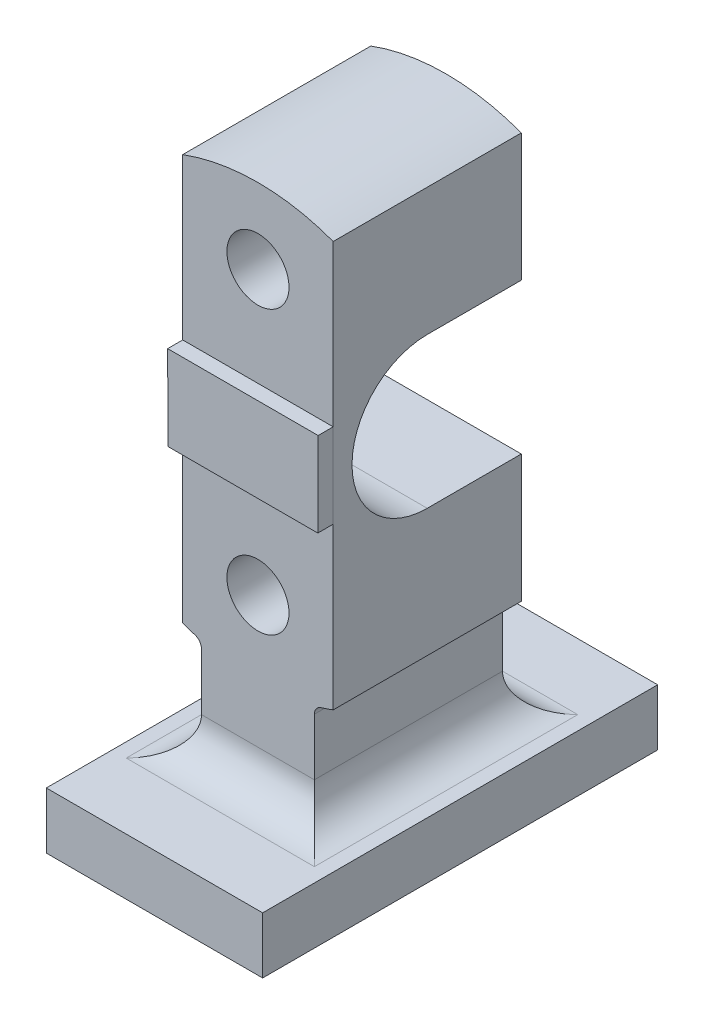
ISO-10303-21;
HEADER;
FILE_DESCRIPTION(('STEP AP214'),'2;1');
FILE_NAME('part.step','',(''),(''),'','','');
FILE_SCHEMA(('AUTOMOTIVE_DESIGN { 1 0 10303 214 1 1 1 1 }'));
ENDSEC;
DATA;
#1=APPLICATION_CONTEXT('core data for automotive mechanical design processes');
#2=APPLICATION_PROTOCOL_DEFINITION('international standard','automotive_design',2000,#1);
#3=PRODUCT_CONTEXT('',#1,'mechanical');
#4=PRODUCT('Part','Part','',(#3));
#5=PRODUCT_RELATED_PRODUCT_CATEGORY('part','',(#4));
#6=PRODUCT_DEFINITION_FORMATION('','',#4);
#7=PRODUCT_DEFINITION_CONTEXT('part definition',#1,'design');
#8=PRODUCT_DEFINITION('design','',#6,#7);
#9=PRODUCT_DEFINITION_SHAPE('','',#8);
#10=(LENGTH_UNIT() NAMED_UNIT(*) SI_UNIT(.MILLI.,.METRE.));
#11=(NAMED_UNIT(*) PLANE_ANGLE_UNIT() SI_UNIT($,.RADIAN.));
#12=(NAMED_UNIT(*) SI_UNIT($,.STERADIAN.) SOLID_ANGLE_UNIT());
#13=UNCERTAINTY_MEASURE_WITH_UNIT(LENGTH_MEASURE(1.E-05),#10,'distance_accuracy_value','');
#14=(GEOMETRIC_REPRESENTATION_CONTEXT(3) GLOBAL_UNCERTAINTY_ASSIGNED_CONTEXT((#13)) GLOBAL_UNIT_ASSIGNED_CONTEXT((#10,
#11,#12)) REPRESENTATION_CONTEXT('',''));
#15=CARTESIAN_POINT('',(0.,0.,0.));
#16=DIRECTION('',(0.,0.,1.));
#17=DIRECTION('',(1.,0.,0.));
#18=AXIS2_PLACEMENT_3D('',#15,#16,#17);
#19=CARTESIAN_POINT('',(0.,0.,50.));
#20=DIRECTION('',(0.,0.,1.));
#21=DIRECTION('',(1.,0.,0.));
#22=AXIS2_PLACEMENT_3D('',#19,#20,#21);
#23=PLANE('',#22);
#24=DIRECTION('',(1.,0.,0.));
#25=VECTOR('',#24,1.);
#26=CARTESIAN_POINT('',(0.,22.5,50.));
#27=LINE('',#26,#25);
#28=CARTESIAN_POINT('',(-40.,22.5000000000028,50.));
#29=VERTEX_POINT('',#28);
#30=CARTESIAN_POINT('',(40.,22.5,50.));
#31=VERTEX_POINT('',#30);
#32=EDGE_CURVE('E204',#29,#31,#27,.T.);
#33=ORIENTED_EDGE('',*,*,#32,.T.);
#34=DIRECTION('',(0.,-1.,0.));
#35=VECTOR('',#34,1.);
#36=CARTESIAN_POINT('',(40.,0.,50.));
#37=LINE('',#36,#35);
#38=CARTESIAN_POINT('',(40.,107.819293264239,50.));
#39=VERTEX_POINT('',#38);
#40=EDGE_CURVE('E321',#39,#31,#37,.T.);
#41=ORIENTED_EDGE('',*,*,#40,.F.);
#42=CARTESIAN_POINT('',(0.,0.,50.));
#43=DIRECTION('',(0.,0.,1.));
#44=DIRECTION('',(1.,0.,0.));
#45=AXIS2_PLACEMENT_3D('',#42,#43,#44);
#46=CIRCLE('',#45,115.);
#47=CARTESIAN_POINT('',(-40.,107.819293264239,50.));
#48=VERTEX_POINT('',#47);
#49=EDGE_CURVE('E324',#39,#48,#46,.T.);
#50=ORIENTED_EDGE('',*,*,#49,.T.);
#51=DIRECTION('',(0.,-1.,0.));
#52=VECTOR('',#51,1.);
#53=CARTESIAN_POINT('',(-40.,0.,50.));
#54=LINE('',#53,#52);
#55=EDGE_CURVE('E328',#48,#29,#54,.T.);
#56=ORIENTED_EDGE('',*,*,#55,.T.);
#57=EDGE_LOOP('',(#33,#41,#50,#56));
#58=FACE_BOUND('',#57,.T.);
#59=CARTESIAN_POINT('',(0.,75.,50.));
#60=DIRECTION('',(0.,0.,1.));
#61=DIRECTION('',(1.,0.,0.));
#62=AXIS2_PLACEMENT_3D('',#59,#60,#61);
#63=CIRCLE('',#62,16.5);
#64=CARTESIAN_POINT('',(16.5,75.,50.));
#65=VERTEX_POINT('',#64);
#66=EDGE_CURVE('E288',#65,#65,#63,.T.);
#67=ORIENTED_EDGE('',*,*,#66,.F.);
#68=EDGE_LOOP('',(#67));
#69=FACE_BOUND('',#68,.T.);
#70=ADVANCED_FACE('F36',(#58,#69),#23,.T.);
#71=CARTESIAN_POINT('',(0.,0.,-50.));
#72=DIRECTION('',(0.,0.,1.));
#73=DIRECTION('',(1.,0.,0.));
#74=AXIS2_PLACEMENT_3D('',#71,#72,#73);
#75=PLANE('',#74);
#76=CARTESIAN_POINT('',(0.,-75.,-50.));
#77=DIRECTION('',(0.,0.,1.));
#78=DIRECTION('',(1.,0.,0.));
#79=AXIS2_PLACEMENT_3D('',#76,#77,#78);
#80=CIRCLE('',#79,16.5);
#81=CARTESIAN_POINT('',(16.5,-75.,-50.));
#82=VERTEX_POINT('',#81);
#83=EDGE_CURVE('E284',#82,#82,#80,.F.);
#84=ORIENTED_EDGE('',*,*,#83,.F.);
#85=EDGE_LOOP('',(#84));
#86=FACE_BOUND('',#85,.T.);
#87=DIRECTION('',(0.,-1.,0.));
#88=VECTOR('',#87,1.);
#89=CARTESIAN_POINT('',(-40.,0.,-50.));
#90=LINE('',#89,#88);
#91=CARTESIAN_POINT('',(-40.,-40.,-50.));
#92=VERTEX_POINT('',#91);
#93=CARTESIAN_POINT('',(-40.,-107.819293264239,-50.));
#94=VERTEX_POINT('',#93);
#95=EDGE_CURVE('E300',#92,#94,#90,.T.);
#96=ORIENTED_EDGE('',*,*,#95,.F.);
#97=DIRECTION('',(1.,0.,0.));
#98=VECTOR('',#97,1.);
#99=CARTESIAN_POINT('',(0.,-40.,-50.));
#100=LINE('',#99,#98);
#101=CARTESIAN_POINT('',(40.,-40.,-50.));
#102=VERTEX_POINT('',#101);
#103=EDGE_CURVE('E44',#92,#102,#100,.T.);
#104=ORIENTED_EDGE('',*,*,#103,.T.);
#105=DIRECTION('',(0.,-1.,0.));
#106=VECTOR('',#105,1.);
#107=CARTESIAN_POINT('',(40.,0.,-50.));
#108=LINE('',#107,#106);
#109=CARTESIAN_POINT('',(40.,-107.819293264239,-50.));
#110=VERTEX_POINT('',#109);
#111=EDGE_CURVE('E293',#102,#110,#108,.T.);
#112=ORIENTED_EDGE('',*,*,#111,.T.);
#113=CARTESIAN_POINT('',(0.,0.,-50.));
#114=DIRECTION('',(0.,0.,1.));
#115=DIRECTION('',(1.,0.,0.));
#116=AXIS2_PLACEMENT_3D('',#113,#114,#115);
#117=CIRCLE('',#116,115.);
#118=CARTESIAN_POINT('',(33.5416666666667,-109.99980271447,-50.));
#119=VERTEX_POINT('',#118);
#120=EDGE_CURVE('E290',#119,#110,#117,.T.);
#121=ORIENTED_EDGE('',*,*,#120,.F.);
#122=CARTESIAN_POINT('',(35.,-114.78240283249,-50.));
#123=DIRECTION('',(0.,0.,1.));
#124=DIRECTION('',(1.,0.,0.));
#125=AXIS2_PLACEMENT_3D('',#122,#123,#124);
#126=CIRCLE('',#125,5.);
#127=CARTESIAN_POINT('',(30.,-114.78240283249,-50.));
#128=VERTEX_POINT('',#127);
#129=EDGE_CURVE('E393',#119,#128,#126,.T.);
#130=ORIENTED_EDGE('',*,*,#129,.T.);
#131=DIRECTION('',(0.,-1.,0.));
#132=VECTOR('',#131,1.);
#133=CARTESIAN_POINT('',(30.,0.,-50.));
#134=LINE('',#133,#132);
#135=CARTESIAN_POINT('',(30.,-145.000000000001,-50.));
#136=VERTEX_POINT('',#135);
#137=EDGE_CURVE('E287',#128,#136,#134,.T.);
#138=ORIENTED_EDGE('',*,*,#137,.T.);
#139=DIRECTION('',(1.,0.,0.));
#140=VECTOR('',#139,1.);
#141=CARTESIAN_POINT('',(-50.,-145.000000000001,-50.));
#142=LINE('',#141,#140);
#143=CARTESIAN_POINT('',(-30.,-145.000000000001,-50.));
#144=VERTEX_POINT('',#143);
#145=EDGE_CURVE('E363',#136,#144,#142,.F.);
#146=ORIENTED_EDGE('',*,*,#145,.T.);
#147=DIRECTION('',(0.,-1.,0.));
#148=VECTOR('',#147,1.);
#149=CARTESIAN_POINT('',(-30.,0.,-50.));
#150=LINE('',#149,#148);
#151=CARTESIAN_POINT('',(-30.,-114.78240283249,-50.));
#152=VERTEX_POINT('',#151);
#153=EDGE_CURVE('E307',#152,#144,#150,.T.);
#154=ORIENTED_EDGE('',*,*,#153,.F.);
#155=CARTESIAN_POINT('',(-35.,-114.78240283249,-50.));
#156=DIRECTION('',(0.,0.,1.));
#157=DIRECTION('',(1.,0.,0.));
#158=AXIS2_PLACEMENT_3D('',#155,#156,#157);
#159=CIRCLE('',#158,5.);
#160=CARTESIAN_POINT('',(-33.5416666666667,-109.99980271447,-50.));
#161=VERTEX_POINT('',#160);
#162=EDGE_CURVE('E397',#152,#161,#159,.T.);
#163=ORIENTED_EDGE('',*,*,#162,.T.);
#164=CARTESIAN_POINT('',(0.,0.,-50.));
#165=DIRECTION('',(0.,0.,1.));
#166=DIRECTION('',(1.,0.,0.));
#167=AXIS2_PLACEMENT_3D('',#164,#165,#166);
#168=CIRCLE('',#167,115.);
#169=EDGE_CURVE('E304',#94,#161,#168,.T.);
#170=ORIENTED_EDGE('',*,*,#169,.F.);
#171=EDGE_LOOP('',(#96,#104,#112,#121,#130,#138,#146,#154,#163,#170));
#172=FACE_BOUND('',#171,.T.);
#173=ADVANCED_FACE('F404',(#86,#172),#75,.F.);
#174=CARTESIAN_POINT('',(30.,0.,-50.));
#175=DIRECTION('',(-1.,0.,0.));
#176=DIRECTION('',(0.,0.,1.));
#177=AXIS2_PLACEMENT_3D('',#174,#175,#176);
#178=PLANE('',#177);
#179=ORIENTED_EDGE('',*,*,#137,.F.);
#180=DIRECTION('',(0.,0.,1.));
#181=VECTOR('',#180,1.);
#182=CARTESIAN_POINT('',(30.,-114.78240283249,-50.));
#183=LINE('',#182,#181);
#184=CARTESIAN_POINT('',(30.,-114.78240283249,50.));
#185=VERTEX_POINT('',#184);
#186=EDGE_CURVE('E381',#128,#185,#183,.T.);
#187=ORIENTED_EDGE('',*,*,#186,.T.);
#188=DIRECTION('',(0.,-1.,0.));
#189=VECTOR('',#188,1.);
#190=CARTESIAN_POINT('',(30.,0.,50.));
#191=LINE('',#190,#189);
#192=CARTESIAN_POINT('',(30.,-145.000000000001,50.));
#193=VERTEX_POINT('',#192);
#194=EDGE_CURVE('E315',#185,#193,#191,.T.);
#195=ORIENTED_EDGE('',*,*,#194,.T.);
#196=DIRECTION('',(0.,0.,1.));
#197=VECTOR('',#196,1.);
#198=CARTESIAN_POINT('',(30.,-145.000000000001,-70.));
#199=LINE('',#198,#197);
#200=EDGE_CURVE('E372',#193,#136,#199,.F.);
#201=ORIENTED_EDGE('',*,*,#200,.T.);
#202=EDGE_LOOP('',(#179,#187,#195,#201));
#203=FACE_BOUND('',#202,.T.);
#204=ADVANCED_FACE('F424',(#203),#178,.F.);
#205=CARTESIAN_POINT('',(-30.,0.,-50.));
#206=DIRECTION('',(-1.,0.,0.));
#207=DIRECTION('',(0.,0.,1.));
#208=AXIS2_PLACEMENT_3D('',#205,#206,#207);
#209=PLANE('',#208);
#210=DIRECTION('',(0.,-1.,0.));
#211=VECTOR('',#210,1.);
#212=CARTESIAN_POINT('',(-30.,0.,50.));
#213=LINE('',#212,#211);
#214=CARTESIAN_POINT('',(-30.,-114.78240283249,50.));
#215=VERTEX_POINT('',#214);
#216=CARTESIAN_POINT('',(-30.,-145.000000000001,50.));
#217=VERTEX_POINT('',#216);
#218=EDGE_CURVE('E334',#215,#217,#213,.T.);
#219=ORIENTED_EDGE('',*,*,#218,.F.);
#220=DIRECTION('',(0.,0.,-1.));
#221=VECTOR('',#220,1.);
#222=CARTESIAN_POINT('',(-30.,-114.78240283249,-50.));
#223=LINE('',#222,#221);
#224=EDGE_CURVE('E389',#215,#152,#223,.T.);
#225=ORIENTED_EDGE('',*,*,#224,.T.);
#226=ORIENTED_EDGE('',*,*,#153,.T.);
#227=DIRECTION('',(0.,0.,1.));
#228=VECTOR('',#227,1.);
#229=CARTESIAN_POINT('',(-30.,-145.000000000001,-50.));
#230=LINE('',#229,#228);
#231=EDGE_CURVE('E341',#144,#217,#230,.T.);
#232=ORIENTED_EDGE('',*,*,#231,.T.);
#233=EDGE_LOOP('',(#219,#225,#226,#232));
#234=FACE_BOUND('',#233,.T.);
#235=ADVANCED_FACE('F449',(#234),#209,.T.);
#236=CARTESIAN_POINT('',(0.,0.,-50.));
#237=DIRECTION('',(0.,0.,1.));
#238=DIRECTION('',(1.,0.,0.));
#239=AXIS2_PLACEMENT_3D('',#236,#237,#238);
#240=CYLINDRICAL_SURFACE('',#239,115.);
#241=ORIENTED_EDGE('',*,*,#169,.T.);
#242=DIRECTION('',(0.,0.,1.));
#243=VECTOR('',#242,1.);
#244=CARTESIAN_POINT('',(-33.5416666666667,-109.99980271447,-50.));
#245=LINE('',#244,#243);
#246=CARTESIAN_POINT('',(-33.5416666666667,-109.99980271447,50.));
#247=VERTEX_POINT('',#246);
#248=EDGE_CURVE('E386',#161,#247,#245,.T.);
#249=ORIENTED_EDGE('',*,*,#248,.T.);
#250=CARTESIAN_POINT('',(0.,0.,50.));
#251=DIRECTION('',(0.,0.,1.));
#252=DIRECTION('',(1.,0.,0.));
#253=AXIS2_PLACEMENT_3D('',#250,#251,#252);
#254=CIRCLE('',#253,115.);
#255=CARTESIAN_POINT('',(-40.,-107.819293264239,50.));
#256=VERTEX_POINT('',#255);
#257=EDGE_CURVE('E331',#256,#247,#254,.T.);
#258=ORIENTED_EDGE('',*,*,#257,.F.);
#259=DIRECTION('',(0.,0.,1.));
#260=VECTOR('',#259,1.);
#261=CARTESIAN_POINT('',(-40.,-107.819293264239,-50.));
#262=LINE('',#261,#260);
#263=EDGE_CURVE('E338',#94,#256,#262,.T.);
#264=ORIENTED_EDGE('',*,*,#263,.F.);
#265=EDGE_LOOP('',(#241,#249,#258,#264));
#266=FACE_BOUND('',#265,.T.);
#267=ADVANCED_FACE('F455',(#266),#240,.T.);
#268=CARTESIAN_POINT('',(-40.,0.,-50.));
#269=DIRECTION('',(-1.,0.,0.));
#270=DIRECTION('',(0.,0.,1.));
#271=AXIS2_PLACEMENT_3D('',#268,#269,#270);
#272=PLANE('',#271);
#273=DIRECTION('',(0.,0.,1.));
#274=VECTOR('',#273,1.);
#275=CARTESIAN_POINT('',(-40.,-40.,0.));
#276=LINE('',#275,#274);
#277=CARTESIAN_POINT('',(-40.,-40.,0.));
#278=VERTEX_POINT('',#277);
#279=EDGE_CURVE('E240',#92,#278,#276,.T.);
#280=ORIENTED_EDGE('',*,*,#279,.F.);
#281=ORIENTED_EDGE('',*,*,#95,.T.);
#282=ORIENTED_EDGE('',*,*,#263,.T.);
#283=EDGE_CURVE('E327',#29,#256,#54,.T.);
#284=ORIENTED_EDGE('',*,*,#283,.F.);
#285=ORIENTED_EDGE('',*,*,#55,.F.);
#286=DIRECTION('',(0.,0.,1.));
#287=VECTOR('',#286,1.);
#288=CARTESIAN_POINT('',(-40.,107.819293264239,-50.));
#289=LINE('',#288,#287);
#290=CARTESIAN_POINT('',(-40.,107.819293264239,-50.));
#291=VERTEX_POINT('',#290);
#292=EDGE_CURVE('E342',#291,#48,#289,.T.);
#293=ORIENTED_EDGE('',*,*,#292,.F.);
#294=CARTESIAN_POINT('',(-40.,40.,-50.));
#295=VERTEX_POINT('',#294);
#296=EDGE_CURVE('E301',#291,#295,#90,.T.);
#297=ORIENTED_EDGE('',*,*,#296,.T.);
#298=DIRECTION('',(0.,0.,-1.));
#299=VECTOR('',#298,1.);
#300=CARTESIAN_POINT('',(-40.,40.,0.));
#301=LINE('',#300,#299);
#302=CARTESIAN_POINT('',(-40.,40.,0.));
#303=VERTEX_POINT('',#302);
#304=EDGE_CURVE('E59',#303,#295,#301,.T.);
#305=ORIENTED_EDGE('',*,*,#304,.F.);
#306=CARTESIAN_POINT('',(-40.,0.,0.));
#307=DIRECTION('',(-1.,0.,0.));
#308=DIRECTION('',(0.,0.,1.));
#309=AXIS2_PLACEMENT_3D('',#306,#307,#308);
#310=CIRCLE('',#309,40.);
#311=EDGE_CURVE('E209',#278,#303,#310,.T.);
#312=ORIENTED_EDGE('',*,*,#311,.F.);
#313=EDGE_LOOP('',(#280,#281,#282,#284,#285,#293,#297,#305,#312));
#314=FACE_BOUND('',#313,.T.);
#315=ADVANCED_FACE('F459',(#314),#272,.T.);
#316=CARTESIAN_POINT('',(0.,0.,-50.));
#317=DIRECTION('',(0.,0.,1.));
#318=DIRECTION('',(1.,0.,0.));
#319=AXIS2_PLACEMENT_3D('',#316,#317,#318);
#320=CYLINDRICAL_SURFACE('',#319,115.);
#321=ORIENTED_EDGE('',*,*,#49,.F.);
#322=DIRECTION('',(0.,0.,1.));
#323=VECTOR('',#322,1.);
#324=CARTESIAN_POINT('',(40.,107.819293264239,-50.));
#325=LINE('',#324,#323);
#326=CARTESIAN_POINT('',(40.,107.819293264239,-50.));
#327=VERTEX_POINT('',#326);
#328=EDGE_CURVE('E344',#327,#39,#325,.T.);
#329=ORIENTED_EDGE('',*,*,#328,.F.);
#330=CARTESIAN_POINT('',(0.,0.,-50.));
#331=DIRECTION('',(0.,0.,1.));
#332=DIRECTION('',(1.,0.,0.));
#333=AXIS2_PLACEMENT_3D('',#330,#331,#332);
#334=CIRCLE('',#333,115.);
#335=EDGE_CURVE('E297',#327,#291,#334,.T.);
#336=ORIENTED_EDGE('',*,*,#335,.T.);
#337=ORIENTED_EDGE('',*,*,#292,.T.);
#338=EDGE_LOOP('',(#321,#329,#336,#337));
#339=FACE_BOUND('',#338,.T.);
#340=ADVANCED_FACE('F475',(#339),#320,.T.);
#341=CARTESIAN_POINT('',(40.,0.,-50.));
#342=DIRECTION('',(-1.,0.,0.));
#343=DIRECTION('',(0.,0.,1.));
#344=AXIS2_PLACEMENT_3D('',#341,#342,#343);
#345=PLANE('',#344);
#346=ORIENTED_EDGE('',*,*,#111,.F.);
#347=DIRECTION('',(0.,0.,1.));
#348=VECTOR('',#347,1.);
#349=CARTESIAN_POINT('',(40.,-40.,-50.));
#350=LINE('',#349,#348);
#351=CARTESIAN_POINT('',(40.,-40.,0.));
#352=VERTEX_POINT('',#351);
#353=EDGE_CURVE('E250',#102,#352,#350,.T.);
#354=ORIENTED_EDGE('',*,*,#353,.T.);
#355=CARTESIAN_POINT('',(40.,0.,0.));
#356=DIRECTION('',(-1.,0.,0.));
#357=DIRECTION('',(0.,0.,1.));
#358=AXIS2_PLACEMENT_3D('',#355,#356,#357);
#359=CIRCLE('',#358,40.);
#360=CARTESIAN_POINT('',(40.,40.,0.));
#361=VERTEX_POINT('',#360);
#362=EDGE_CURVE('E11',#352,#361,#359,.T.);
#363=ORIENTED_EDGE('',*,*,#362,.T.);
#364=DIRECTION('',(0.,0.,-1.));
#365=VECTOR('',#364,1.);
#366=CARTESIAN_POINT('',(40.,40.,-50.));
#367=LINE('',#366,#365);
#368=CARTESIAN_POINT('',(40.,40.,-50.));
#369=VERTEX_POINT('',#368);
#370=EDGE_CURVE('E246',#361,#369,#367,.T.);
#371=ORIENTED_EDGE('',*,*,#370,.T.);
#372=EDGE_CURVE('E294',#327,#369,#108,.T.);
#373=ORIENTED_EDGE('',*,*,#372,.F.);
#374=ORIENTED_EDGE('',*,*,#328,.T.);
#375=ORIENTED_EDGE('',*,*,#40,.T.);
#376=CARTESIAN_POINT('',(40.,-107.819293264239,50.));
#377=VERTEX_POINT('',#376);
#378=EDGE_CURVE('E320',#31,#377,#37,.T.);
#379=ORIENTED_EDGE('',*,*,#378,.T.);
#380=DIRECTION('',(0.,0.,1.));
#381=VECTOR('',#380,1.);
#382=CARTESIAN_POINT('',(40.,-107.819293264239,-50.));
#383=LINE('',#382,#381);
#384=EDGE_CURVE('E312',#110,#377,#383,.T.);
#385=ORIENTED_EDGE('',*,*,#384,.F.);
#386=EDGE_LOOP('',(#346,#354,#363,#371,#373,#374,#375,#379,#385));
#387=FACE_BOUND('',#386,.T.);
#388=ADVANCED_FACE('F411',(#387),#345,.F.);
#389=CARTESIAN_POINT('',(0.,0.,-50.));
#390=DIRECTION('',(0.,0.,1.));
#391=DIRECTION('',(1.,0.,0.));
#392=AXIS2_PLACEMENT_3D('',#389,#390,#391);
#393=CYLINDRICAL_SURFACE('',#392,115.);
#394=CARTESIAN_POINT('',(0.,0.,50.));
#395=DIRECTION('',(0.,0.,1.));
#396=DIRECTION('',(1.,0.,0.));
#397=AXIS2_PLACEMENT_3D('',#394,#395,#396);
#398=CIRCLE('',#397,115.);
#399=CARTESIAN_POINT('',(33.5416666666667,-109.99980271447,50.));
#400=VERTEX_POINT('',#399);
#401=EDGE_CURVE('E317',#400,#377,#398,.T.);
#402=ORIENTED_EDGE('',*,*,#401,.F.);
#403=DIRECTION('',(0.,0.,1.));
#404=VECTOR('',#403,1.);
#405=CARTESIAN_POINT('',(33.5416666666667,-109.99980271447,-50.));
#406=LINE('',#405,#404);
#407=EDGE_CURVE('E384',#400,#119,#406,.F.);
#408=ORIENTED_EDGE('',*,*,#407,.T.);
#409=ORIENTED_EDGE('',*,*,#120,.T.);
#410=ORIENTED_EDGE('',*,*,#384,.T.);
#411=EDGE_LOOP('',(#402,#408,#409,#410));
#412=FACE_BOUND('',#411,.T.);
#413=ADVANCED_FACE('F415',(#412),#393,.T.);
#414=CARTESIAN_POINT('',(0.,-75.,-50.));
#415=DIRECTION('',(0.,0.,1.));
#416=DIRECTION('',(1.,0.,0.));
#417=AXIS2_PLACEMENT_3D('',#414,#415,#416);
#418=CYLINDRICAL_SURFACE('',#417,16.5);
#419=ORIENTED_EDGE('',*,*,#83,.T.);
#420=EDGE_LOOP('',(#419));
#421=FACE_BOUND('',#420,.T.);
#422=CARTESIAN_POINT('',(0.,-75.,50.));
#423=DIRECTION('',(0.,0.,1.));
#424=DIRECTION('',(1.,0.,0.));
#425=AXIS2_PLACEMENT_3D('',#422,#423,#424);
#426=CIRCLE('',#425,16.5);
#427=CARTESIAN_POINT('',(16.5,-75.,50.));
#428=VERTEX_POINT('',#427);
#429=EDGE_CURVE('E283',#428,#428,#426,.F.);
#430=ORIENTED_EDGE('',*,*,#429,.F.);
#431=EDGE_LOOP('',(#430));
#432=FACE_BOUND('',#431,.T.);
#433=ADVANCED_FACE('F513',(#421,#432),#418,.F.);
#434=CARTESIAN_POINT('',(0.,75.,-50.));
#435=DIRECTION('',(0.,0.,1.));
#436=DIRECTION('',(1.,0.,0.));
#437=AXIS2_PLACEMENT_3D('',#434,#435,#436);
#438=CYLINDRICAL_SURFACE('',#437,16.5);
#439=CARTESIAN_POINT('',(0.,75.,-50.));
#440=DIRECTION('',(0.,0.,1.));
#441=DIRECTION('',(1.,0.,0.));
#442=AXIS2_PLACEMENT_3D('',#439,#440,#441);
#443=CIRCLE('',#442,16.5);
#444=CARTESIAN_POINT('',(16.5,75.,-50.));
#445=VERTEX_POINT('',#444);
#446=EDGE_CURVE('E309',#445,#445,#443,.T.);
#447=ORIENTED_EDGE('',*,*,#446,.F.);
#448=EDGE_LOOP('',(#447));
#449=FACE_BOUND('',#448,.T.);
#450=ORIENTED_EDGE('',*,*,#66,.T.);
#451=EDGE_LOOP('',(#450));
#452=FACE_BOUND('',#451,.T.);
#453=ADVANCED_FACE('F509',(#449,#452),#438,.F.);
#454=ORIENTED_EDGE('',*,*,#372,.T.);
#455=DIRECTION('',(-1.,0.,0.));
#456=VECTOR('',#455,1.);
#457=CARTESIAN_POINT('',(0.,40.,-50.));
#458=LINE('',#457,#456);
#459=EDGE_CURVE('E399',#369,#295,#458,.T.);
#460=ORIENTED_EDGE('',*,*,#459,.T.);
#461=ORIENTED_EDGE('',*,*,#296,.F.);
#462=ORIENTED_EDGE('',*,*,#335,.F.);
#463=EDGE_LOOP('',(#454,#460,#461,#462));
#464=FACE_BOUND('',#463,.T.);
#465=ORIENTED_EDGE('',*,*,#446,.T.);
#466=EDGE_LOOP('',(#465));
#467=FACE_BOUND('',#466,.T.);
#468=ADVANCED_FACE('F470',(#464,#467),#75,.F.);
#469=DIRECTION('',(-0.00405798036263045,0.999991766363792,0.));
#470=VECTOR('',#469,1.);
#471=CARTESIAN_POINT('',(-39.9080375054244,-0.161947365923827,50.));
#472=LINE('',#471,#470);
#473=CARTESIAN_POINT('',(-39.8173893801322,-22.5,50.));
#474=VERTEX_POINT('',#473);
#475=EDGE_CURVE('E229',#474,#29,#472,.T.);
#476=ORIENTED_EDGE('',*,*,#475,.T.);
#477=ORIENTED_EDGE('',*,*,#283,.T.);
#478=ORIENTED_EDGE('',*,*,#257,.T.);
#479=CARTESIAN_POINT('',(-35.,-114.78240283249,50.));
#480=DIRECTION('',(0.,0.,1.));
#481=DIRECTION('',(1.,0.,0.));
#482=AXIS2_PLACEMENT_3D('',#479,#480,#481);
#483=CIRCLE('',#482,5.);
#484=EDGE_CURVE('E395',#247,#215,#483,.F.);
#485=ORIENTED_EDGE('',*,*,#484,.T.);
#486=ORIENTED_EDGE('',*,*,#218,.T.);
#487=DIRECTION('',(1.,0.,0.));
#488=VECTOR('',#487,1.);
#489=CARTESIAN_POINT('',(0.,-145.000000000001,50.));
#490=LINE('',#489,#488);
#491=EDGE_CURVE('E352',#217,#193,#490,.T.);
#492=ORIENTED_EDGE('',*,*,#491,.T.);
#493=ORIENTED_EDGE('',*,*,#194,.F.);
#494=CARTESIAN_POINT('',(35.,-114.78240283249,50.));
#495=DIRECTION('',(0.,0.,1.));
#496=DIRECTION('',(1.,0.,0.));
#497=AXIS2_PLACEMENT_3D('',#494,#495,#496);
#498=CIRCLE('',#497,5.);
#499=EDGE_CURVE('E391',#185,#400,#498,.F.);
#500=ORIENTED_EDGE('',*,*,#499,.T.);
#501=ORIENTED_EDGE('',*,*,#401,.T.);
#502=ORIENTED_EDGE('',*,*,#378,.F.);
#503=DIRECTION('',(0.00405798036263045,0.999991766363792,0.));
#504=VECTOR('',#503,1.);
#505=CARTESIAN_POINT('',(39.9080375054244,-0.161947365923827,50.));
#506=LINE('',#505,#504);
#507=CARTESIAN_POINT('',(39.8173893801322,-22.5,50.));
#508=VERTEX_POINT('',#507);
#509=EDGE_CURVE('E218',#508,#31,#506,.T.);
#510=ORIENTED_EDGE('',*,*,#509,.F.);
#511=DIRECTION('',(1.,0.,0.));
#512=VECTOR('',#511,1.);
#513=CARTESIAN_POINT('',(0.,-22.5,50.));
#514=LINE('',#513,#512);
#515=EDGE_CURVE('E231',#474,#508,#514,.T.);
#516=ORIENTED_EDGE('',*,*,#515,.F.);
#517=EDGE_LOOP('',(#476,#477,#478,#485,#486,#492,#493,#500,#501,#502,#510,#516));
#518=FACE_BOUND('',#517,.T.);
#519=ORIENTED_EDGE('',*,*,#429,.T.);
#520=EDGE_LOOP('',(#519));
#521=FACE_BOUND('',#520,.T.);
#522=ADVANCED_FACE('F426',(#518,#521),#23,.T.);
#523=CARTESIAN_POINT('',(-57.5,-165.000000000001,105.));
#524=DIRECTION('',(1.,0.,0.));
#525=DIRECTION('',(0.,0.,-1.));
#526=AXIS2_PLACEMENT_3D('',#523,#524,#525);
#527=PLANE('',#526);
#528=DIRECTION('',(0.,-1.,0.));
#529=VECTOR('',#528,1.);
#530=CARTESIAN_POINT('',(-57.5,-165.000000000001,-105.));
#531=LINE('',#530,#529);
#532=CARTESIAN_POINT('',(-57.5,-165.000000000001,-105.));
#533=VERTEX_POINT('',#532);
#534=CARTESIAN_POINT('',(-57.5,-195.000000000001,-105.));
#535=VERTEX_POINT('',#534);
#536=EDGE_CURVE('E253',#533,#535,#531,.T.);
#537=ORIENTED_EDGE('',*,*,#536,.T.);
#538=DIRECTION('',(0.,0.,-1.));
#539=VECTOR('',#538,1.);
#540=CARTESIAN_POINT('',(-57.5,-195.000000000001,105.));
#541=LINE('',#540,#539);
#542=CARTESIAN_POINT('',(-57.5,-195.000000000001,105.));
#543=VERTEX_POINT('',#542);
#544=EDGE_CURVE('E280',#543,#535,#541,.T.);
#545=ORIENTED_EDGE('',*,*,#544,.F.);
#546=DIRECTION('',(0.,-1.,0.));
#547=VECTOR('',#546,1.);
#548=CARTESIAN_POINT('',(-57.5,-165.000000000001,105.));
#549=LINE('',#548,#547);
#550=CARTESIAN_POINT('',(-57.5,-165.000000000001,105.));
#551=VERTEX_POINT('',#550);
#552=EDGE_CURVE('E254',#551,#543,#549,.T.);
#553=ORIENTED_EDGE('',*,*,#552,.F.);
#554=DIRECTION('',(0.,0.,-1.));
#555=VECTOR('',#554,1.);
#556=CARTESIAN_POINT('',(-57.5,-165.000000000001,105.));
#557=LINE('',#556,#555);
#558=EDGE_CURVE('E264',#551,#533,#557,.T.);
#559=ORIENTED_EDGE('',*,*,#558,.T.);
#560=EDGE_LOOP('',(#537,#545,#553,#559));
#561=FACE_BOUND('',#560,.T.);
#562=ADVANCED_FACE('F501',(#561),#527,.F.);
#563=CARTESIAN_POINT('',(-57.5,-195.000000000001,105.));
#564=DIRECTION('',(0.,1.,0.));
#565=DIRECTION('',(0.,0.,1.));
#566=AXIS2_PLACEMENT_3D('',#563,#564,#565);
#567=PLANE('',#566);
#568=DIRECTION('',(1.,0.,0.));
#569=VECTOR('',#568,1.);
#570=CARTESIAN_POINT('',(-57.5,-195.000000000001,-105.));
#571=LINE('',#570,#569);
#572=CARTESIAN_POINT('',(57.5,-195.000000000001,-105.));
#573=VERTEX_POINT('',#572);
#574=EDGE_CURVE('E267',#535,#573,#571,.T.);
#575=ORIENTED_EDGE('',*,*,#574,.T.);
#576=DIRECTION('',(0.,0.,-1.));
#577=VECTOR('',#576,1.);
#578=CARTESIAN_POINT('',(57.5,-195.000000000001,105.));
#579=LINE('',#578,#577);
#580=CARTESIAN_POINT('',(57.5,-195.000000000001,105.));
#581=VERTEX_POINT('',#580);
#582=EDGE_CURVE('E277',#581,#573,#579,.T.);
#583=ORIENTED_EDGE('',*,*,#582,.F.);
#584=DIRECTION('',(1.,0.,0.));
#585=VECTOR('',#584,1.);
#586=CARTESIAN_POINT('',(-57.5,-195.000000000001,105.));
#587=LINE('',#586,#585);
#588=EDGE_CURVE('E257',#543,#581,#587,.T.);
#589=ORIENTED_EDGE('',*,*,#588,.F.);
#590=ORIENTED_EDGE('',*,*,#544,.T.);
#591=EDGE_LOOP('',(#575,#583,#589,#590));
#592=FACE_BOUND('',#591,.T.);
#593=ADVANCED_FACE('F506',(#592),#567,.F.);
#594=CARTESIAN_POINT('',(57.5,-195.000000000001,105.));
#595=DIRECTION('',(-1.,0.,0.));
#596=DIRECTION('',(0.,0.,1.));
#597=AXIS2_PLACEMENT_3D('',#594,#595,#596);
#598=PLANE('',#597);
#599=DIRECTION('',(0.,1.,0.));
#600=VECTOR('',#599,1.);
#601=CARTESIAN_POINT('',(57.5,-195.000000000001,-105.));
#602=LINE('',#601,#600);
#603=CARTESIAN_POINT('',(57.5,-165.000000000001,-105.));
#604=VERTEX_POINT('',#603);
#605=EDGE_CURVE('E269',#573,#604,#602,.T.);
#606=ORIENTED_EDGE('',*,*,#605,.T.);
#607=DIRECTION('',(0.,0.,-1.));
#608=VECTOR('',#607,1.);
#609=CARTESIAN_POINT('',(57.5,-165.000000000001,105.));
#610=LINE('',#609,#608);
#611=CARTESIAN_POINT('',(57.5,-165.000000000001,105.));
#612=VERTEX_POINT('',#611);
#613=EDGE_CURVE('E274',#612,#604,#610,.T.);
#614=ORIENTED_EDGE('',*,*,#613,.F.);
#615=DIRECTION('',(0.,1.,0.));
#616=VECTOR('',#615,1.);
#617=CARTESIAN_POINT('',(57.5,-195.000000000001,105.));
#618=LINE('',#617,#616);
#619=EDGE_CURVE('E260',#581,#612,#618,.T.);
#620=ORIENTED_EDGE('',*,*,#619,.F.);
#621=ORIENTED_EDGE('',*,*,#582,.T.);
#622=EDGE_LOOP('',(#606,#614,#620,#621));
#623=FACE_BOUND('',#622,.T.);
#624=ADVANCED_FACE('F518',(#623),#598,.F.);
#625=CARTESIAN_POINT('',(57.5,-165.000000000001,105.));
#626=DIRECTION('',(0.,-1.,0.));
#627=DIRECTION('',(0.,0.,-1.));
#628=AXIS2_PLACEMENT_3D('',#625,#626,#627);
#629=PLANE('',#628);
#630=DIRECTION('',(0.,0.,1.));
#631=VECTOR('',#630,1.);
#632=CARTESIAN_POINT('',(50.,-165.000000000001,70.));
#633=LINE('',#632,#631);
#634=CARTESIAN_POINT('',(50.,-165.000000000001,-70.));
#635=VERTEX_POINT('',#634);
#636=CARTESIAN_POINT('',(50.,-165.000000000001,70.));
#637=VERTEX_POINT('',#636);
#638=EDGE_CURVE('E369',#635,#637,#633,.T.);
#639=ORIENTED_EDGE('',*,*,#638,.T.);
#640=DIRECTION('',(1.,0.,0.));
#641=VECTOR('',#640,1.);
#642=CARTESIAN_POINT('',(57.5,-165.000000000001,70.));
#643=LINE('',#642,#641);
#644=CARTESIAN_POINT('',(-50.,-165.000000000001,70.));
#645=VERTEX_POINT('',#644);
#646=EDGE_CURVE('E355',#637,#645,#643,.F.);
#647=ORIENTED_EDGE('',*,*,#646,.T.);
#648=DIRECTION('',(0.,0.,1.));
#649=VECTOR('',#648,1.);
#650=CARTESIAN_POINT('',(-50.,-165.000000000001,105.));
#651=LINE('',#650,#649);
#652=CARTESIAN_POINT('',(-50.,-165.000000000001,-70.));
#653=VERTEX_POINT('',#652);
#654=EDGE_CURVE('E350',#645,#653,#651,.F.);
#655=ORIENTED_EDGE('',*,*,#654,.T.);
#656=DIRECTION('',(1.,0.,0.));
#657=VECTOR('',#656,1.);
#658=CARTESIAN_POINT('',(30.,-165.000000000001,-70.));
#659=LINE('',#658,#657);
#660=EDGE_CURVE('E361',#653,#635,#659,.T.);
#661=ORIENTED_EDGE('',*,*,#660,.T.);
#662=EDGE_LOOP('',(#639,#647,#655,#661));
#663=FACE_BOUND('',#662,.T.);
#664=DIRECTION('',(-1.,0.,0.));
#665=VECTOR('',#664,1.);
#666=CARTESIAN_POINT('',(57.5,-165.000000000001,-105.));
#667=LINE('',#666,#665);
#668=EDGE_CURVE('E258',#604,#533,#667,.T.);
#669=ORIENTED_EDGE('',*,*,#668,.T.);
#670=ORIENTED_EDGE('',*,*,#558,.F.);
#671=DIRECTION('',(-1.,0.,0.));
#672=VECTOR('',#671,1.);
#673=CARTESIAN_POINT('',(57.5,-165.000000000001,105.));
#674=LINE('',#673,#672);
#675=EDGE_CURVE('E262',#612,#551,#674,.T.);
#676=ORIENTED_EDGE('',*,*,#675,.F.);
#677=ORIENTED_EDGE('',*,*,#613,.T.);
#678=EDGE_LOOP('',(#669,#670,#676,#677));
#679=FACE_BOUND('',#678,.T.);
#680=ADVANCED_FACE('F522',(#663,#679),#629,.F.);
#681=CARTESIAN_POINT('',(0.,0.,105.));
#682=DIRECTION('',(0.,0.,1.));
#683=DIRECTION('',(1.,0.,0.));
#684=AXIS2_PLACEMENT_3D('',#681,#682,#683);
#685=PLANE('',#684);
#686=ORIENTED_EDGE('',*,*,#552,.T.);
#687=ORIENTED_EDGE('',*,*,#588,.T.);
#688=ORIENTED_EDGE('',*,*,#619,.T.);
#689=ORIENTED_EDGE('',*,*,#675,.T.);
#690=EDGE_LOOP('',(#686,#687,#688,#689));
#691=FACE_BOUND('',#690,.T.);
#692=ADVANCED_FACE('F526',(#691),#685,.T.);
#693=CARTESIAN_POINT('',(0.,0.,-105.));
#694=DIRECTION('',(0.,0.,1.));
#695=DIRECTION('',(1.,0.,0.));
#696=AXIS2_PLACEMENT_3D('',#693,#694,#695);
#697=PLANE('',#696);
#698=ORIENTED_EDGE('',*,*,#536,.F.);
#699=ORIENTED_EDGE('',*,*,#668,.F.);
#700=ORIENTED_EDGE('',*,*,#605,.F.);
#701=ORIENTED_EDGE('',*,*,#574,.F.);
#702=EDGE_LOOP('',(#698,#699,#700,#701));
#703=FACE_BOUND('',#702,.T.);
#704=ADVANCED_FACE('F528',(#703),#697,.F.);
#705=CARTESIAN_POINT('',(-50.,-145.000000000001,-50.));
#706=DIRECTION('',(0.,0.,1.));
#707=DIRECTION('',(1.,0.,0.));
#708=AXIS2_PLACEMENT_3D('',#705,#706,#707);
#709=CYLINDRICAL_SURFACE('',#708,20.);
#710=ORIENTED_EDGE('',*,*,#231,.F.);
#711=CARTESIAN_POINT('',(-50.,-145.000000000001,-70.));
#712=DIRECTION('',(-0.707106781186547,0.,0.707106781186547));
#713=DIRECTION('',(0.707106781186547,0.,0.707106781186547));
#714=AXIS2_PLACEMENT_3D('',#711,#712,#713);
#715=ELLIPSE('',#714,28.2842712474619,20.);
#716=EDGE_CURVE('E366',#144,#653,#715,.F.);
#717=ORIENTED_EDGE('',*,*,#716,.T.);
#718=ORIENTED_EDGE('',*,*,#654,.F.);
#719=CARTESIAN_POINT('',(-50.,-145.000000000001,70.));
#720=DIRECTION('',(0.707106781186547,0.,0.707106781186547));
#721=DIRECTION('',(-0.707106781186547,0.,0.707106781186547));
#722=AXIS2_PLACEMENT_3D('',#719,#720,#721);
#723=ELLIPSE('',#722,28.2842712474619,20.);
#724=EDGE_CURVE('E358',#645,#217,#723,.T.);
#725=ORIENTED_EDGE('',*,*,#724,.T.);
#726=EDGE_LOOP('',(#710,#717,#718,#725));
#727=FACE_BOUND('',#726,.T.);
#728=ADVANCED_FACE('F447',(#727),#709,.F.);
#729=CARTESIAN_POINT('',(0.,-145.000000000001,70.));
#730=DIRECTION('',(1.,0.,0.));
#731=DIRECTION('',(0.,0.,-1.));
#732=AXIS2_PLACEMENT_3D('',#729,#730,#731);
#733=CYLINDRICAL_SURFACE('',#732,20.);
#734=ORIENTED_EDGE('',*,*,#724,.F.);
#735=ORIENTED_EDGE('',*,*,#646,.F.);
#736=CARTESIAN_POINT('',(50.,-145.000000000001,70.));
#737=DIRECTION('',(0.707106781186547,0.,-0.707106781186547));
#738=DIRECTION('',(0.707106781186547,0.,0.707106781186547));
#739=AXIS2_PLACEMENT_3D('',#736,#737,#738);
#740=ELLIPSE('',#739,28.2842712474619,20.);
#741=EDGE_CURVE('E375',#637,#193,#740,.T.);
#742=ORIENTED_EDGE('',*,*,#741,.T.);
#743=ORIENTED_EDGE('',*,*,#491,.F.);
#744=EDGE_LOOP('',(#734,#735,#742,#743));
#745=FACE_BOUND('',#744,.T.);
#746=ADVANCED_FACE('F652',(#745),#733,.F.);
#747=CARTESIAN_POINT('',(57.5,-145.000000000001,-70.));
#748=DIRECTION('',(-1.,0.,0.));
#749=DIRECTION('',(0.,0.,1.));
#750=AXIS2_PLACEMENT_3D('',#747,#748,#749);
#751=CYLINDRICAL_SURFACE('',#750,20.);
#752=ORIENTED_EDGE('',*,*,#716,.F.);
#753=ORIENTED_EDGE('',*,*,#145,.F.);
#754=CARTESIAN_POINT('',(50.,-145.000000000001,-70.));
#755=DIRECTION('',(-0.707106781186547,0.,-0.707106781186547));
#756=DIRECTION('',(-0.707106781186547,0.,0.707106781186547));
#757=AXIS2_PLACEMENT_3D('',#754,#755,#756);
#758=ELLIPSE('',#757,28.2842712474619,20.);
#759=EDGE_CURVE('E378',#136,#635,#758,.F.);
#760=ORIENTED_EDGE('',*,*,#759,.T.);
#761=ORIENTED_EDGE('',*,*,#660,.F.);
#762=EDGE_LOOP('',(#752,#753,#760,#761));
#763=FACE_BOUND('',#762,.T.);
#764=ADVANCED_FACE('F441',(#763),#751,.F.);
#765=CARTESIAN_POINT('',(50.,-145.000000000001,105.));
#766=DIRECTION('',(0.,0.,-1.));
#767=DIRECTION('',(-1.,0.,0.));
#768=AXIS2_PLACEMENT_3D('',#765,#766,#767);
#769=CYLINDRICAL_SURFACE('',#768,20.);
#770=ORIENTED_EDGE('',*,*,#759,.F.);
#771=ORIENTED_EDGE('',*,*,#200,.F.);
#772=ORIENTED_EDGE('',*,*,#741,.F.);
#773=ORIENTED_EDGE('',*,*,#638,.F.);
#774=EDGE_LOOP('',(#770,#771,#772,#773));
#775=FACE_BOUND('',#774,.T.);
#776=ADVANCED_FACE('F436',(#775),#769,.F.);
#777=CARTESIAN_POINT('',(35.,-114.78240283249,-50.));
#778=DIRECTION('',(0.,0.,1.));
#779=DIRECTION('',(1.,0.,0.));
#780=AXIS2_PLACEMENT_3D('',#777,#778,#779);
#781=CYLINDRICAL_SURFACE('',#780,5.);
#782=ORIENTED_EDGE('',*,*,#129,.F.);
#783=ORIENTED_EDGE('',*,*,#407,.F.);
#784=ORIENTED_EDGE('',*,*,#499,.F.);
#785=ORIENTED_EDGE('',*,*,#186,.F.);
#786=EDGE_LOOP('',(#782,#783,#784,#785));
#787=FACE_BOUND('',#786,.T.);
#788=ADVANCED_FACE('F421',(#787),#781,.F.);
#789=CARTESIAN_POINT('',(-35.,-114.78240283249,-50.));
#790=DIRECTION('',(0.,0.,1.));
#791=DIRECTION('',(1.,0.,0.));
#792=AXIS2_PLACEMENT_3D('',#789,#790,#791);
#793=CYLINDRICAL_SURFACE('',#792,5.);
#794=ORIENTED_EDGE('',*,*,#162,.F.);
#795=ORIENTED_EDGE('',*,*,#224,.F.);
#796=ORIENTED_EDGE('',*,*,#484,.F.);
#797=ORIENTED_EDGE('',*,*,#248,.F.);
#798=EDGE_LOOP('',(#794,#795,#796,#797));
#799=FACE_BOUND('',#798,.T.);
#800=ADVANCED_FACE('F38',(#799),#793,.F.);
#801=CARTESIAN_POINT('',(97.9999999999999,0.,0.));
#802=DIRECTION('',(-1.,0.,0.));
#803=DIRECTION('',(0.,0.,1.));
#804=AXIS2_PLACEMENT_3D('',#801,#802,#803);
#805=CYLINDRICAL_SURFACE('',#804,40.);
#806=DIRECTION('',(-1.,0.,0.));
#807=VECTOR('',#806,1.);
#808=CARTESIAN_POINT('',(97.9999999999999,-40.,0.));
#809=LINE('',#808,#807);
#810=EDGE_CURVE('E244',#352,#278,#809,.T.);
#811=ORIENTED_EDGE('',*,*,#810,.T.);
#812=ORIENTED_EDGE('',*,*,#311,.T.);
#813=DIRECTION('',(-1.,0.,0.));
#814=VECTOR('',#813,1.);
#815=CARTESIAN_POINT('',(97.9999999999999,40.,0.));
#816=LINE('',#815,#814);
#817=EDGE_CURVE('E243',#361,#303,#816,.T.);
#818=ORIENTED_EDGE('',*,*,#817,.F.);
#819=ORIENTED_EDGE('',*,*,#362,.F.);
#820=EDGE_LOOP('',(#811,#812,#818,#819));
#821=FACE_BOUND('',#820,.T.);
#822=ADVANCED_FACE('F465',(#821),#805,.F.);
#823=CARTESIAN_POINT('',(97.9999999999999,-40.,0.));
#824=DIRECTION('',(0.,-1.,0.));
#825=DIRECTION('',(0.,0.,-1.));
#826=AXIS2_PLACEMENT_3D('',#823,#824,#825);
#827=PLANE('',#826);
#828=ORIENTED_EDGE('',*,*,#103,.F.);
#829=ORIENTED_EDGE('',*,*,#279,.T.);
#830=ORIENTED_EDGE('',*,*,#810,.F.);
#831=ORIENTED_EDGE('',*,*,#353,.F.);
#832=EDGE_LOOP('',(#828,#829,#830,#831));
#833=FACE_BOUND('',#832,.T.);
#834=ADVANCED_FACE('F463',(#833),#827,.F.);
#835=CARTESIAN_POINT('',(97.9999999999999,40.,0.));
#836=DIRECTION('',(0.,1.,0.));
#837=DIRECTION('',(0.,0.,1.));
#838=AXIS2_PLACEMENT_3D('',#835,#836,#837);
#839=PLANE('',#838);
#840=ORIENTED_EDGE('',*,*,#817,.T.);
#841=ORIENTED_EDGE('',*,*,#304,.T.);
#842=ORIENTED_EDGE('',*,*,#459,.F.);
#843=ORIENTED_EDGE('',*,*,#370,.F.);
#844=EDGE_LOOP('',(#840,#841,#842,#843));
#845=FACE_BOUND('',#844,.T.);
#846=ADVANCED_FACE('F537',(#845),#839,.F.);
#847=CARTESIAN_POINT('',(0.,22.5,58.));
#848=DIRECTION('',(0.,1.,0.));
#849=DIRECTION('',(0.,0.,1.));
#850=AXIS2_PLACEMENT_3D('',#847,#848,#849);
#851=PLANE('',#850);
#852=ORIENTED_EDGE('',*,*,#32,.F.);
#853=DIRECTION('',(0.,0.,-1.));
#854=VECTOR('',#853,1.);
#855=CARTESIAN_POINT('',(-40.,22.5000000000028,58.));
#856=LINE('',#855,#854);
#857=CARTESIAN_POINT('',(-40.,22.5000000000028,58.));
#858=VERTEX_POINT('',#857);
#859=EDGE_CURVE('E199',#858,#29,#856,.T.);
#860=ORIENTED_EDGE('',*,*,#859,.F.);
#861=DIRECTION('',(1.,0.,0.));
#862=VECTOR('',#861,1.);
#863=CARTESIAN_POINT('',(0.,22.5,58.));
#864=LINE('',#863,#862);
#865=CARTESIAN_POINT('',(40.,22.5,58.));
#866=VERTEX_POINT('',#865);
#867=EDGE_CURVE('E202',#858,#866,#864,.T.);
#868=ORIENTED_EDGE('',*,*,#867,.T.);
#869=DIRECTION('',(0.,0.,-1.));
#870=VECTOR('',#869,1.);
#871=CARTESIAN_POINT('',(40.,22.5,58.));
#872=LINE('',#871,#870);
#873=EDGE_CURVE('E227',#866,#31,#872,.T.);
#874=ORIENTED_EDGE('',*,*,#873,.T.);
#875=EDGE_LOOP('',(#852,#860,#868,#874));
#876=FACE_BOUND('',#875,.T.);
#877=ADVANCED_FACE('F201',(#876),#851,.T.);
#878=CARTESIAN_POINT('',(-39.9080375054244,-0.161947365923827,58.));
#879=DIRECTION('',(-0.999991766363792,-0.00405798036263045,0.));
#880=DIRECTION('',(0.00405798036263045,-0.999991766363792,0.));
#881=AXIS2_PLACEMENT_3D('',#878,#879,#880);
#882=PLANE('',#881);
#883=ORIENTED_EDGE('',*,*,#475,.F.);
#884=DIRECTION('',(0.,0.,-1.));
#885=VECTOR('',#884,1.);
#886=CARTESIAN_POINT('',(-39.8173893801322,-22.5,58.));
#887=LINE('',#886,#885);
#888=CARTESIAN_POINT('',(-39.8173893801322,-22.5,58.));
#889=VERTEX_POINT('',#888);
#890=EDGE_CURVE('E210',#889,#474,#887,.T.);
#891=ORIENTED_EDGE('',*,*,#890,.F.);
#892=DIRECTION('',(-0.00405798036263045,0.999991766363792,0.));
#893=VECTOR('',#892,1.);
#894=CARTESIAN_POINT('',(-39.9080375054244,-0.161947365923827,58.));
#895=LINE('',#894,#893);
#896=EDGE_CURVE('E215',#889,#858,#895,.T.);
#897=ORIENTED_EDGE('',*,*,#896,.T.);
#898=ORIENTED_EDGE('',*,*,#859,.T.);
#899=EDGE_LOOP('',(#883,#891,#897,#898));
#900=FACE_BOUND('',#899,.T.);
#901=ADVANCED_FACE('F220',(#900),#882,.T.);
#902=CARTESIAN_POINT('',(0.,-22.5,58.));
#903=DIRECTION('',(0.,1.,0.));
#904=DIRECTION('',(0.,0.,1.));
#905=AXIS2_PLACEMENT_3D('',#902,#903,#904);
#906=PLANE('',#905);
#907=ORIENTED_EDGE('',*,*,#515,.T.);
#908=DIRECTION('',(0.,0.,-1.));
#909=VECTOR('',#908,1.);
#910=CARTESIAN_POINT('',(39.8173893801322,-22.5,58.));
#911=LINE('',#910,#909);
#912=CARTESIAN_POINT('',(39.8173893801322,-22.5,58.));
#913=VERTEX_POINT('',#912);
#914=EDGE_CURVE('E51',#913,#508,#911,.T.);
#915=ORIENTED_EDGE('',*,*,#914,.F.);
#916=DIRECTION('',(1.,0.,0.));
#917=VECTOR('',#916,1.);
#918=CARTESIAN_POINT('',(0.,-22.5,58.));
#919=LINE('',#918,#917);
#920=EDGE_CURVE('E222',#889,#913,#919,.T.);
#921=ORIENTED_EDGE('',*,*,#920,.F.);
#922=ORIENTED_EDGE('',*,*,#890,.T.);
#923=EDGE_LOOP('',(#907,#915,#921,#922));
#924=FACE_BOUND('',#923,.T.);
#925=ADVANCED_FACE('F483',(#924),#906,.F.);
#926=CARTESIAN_POINT('',(39.9080375054244,-0.161947365923827,58.));
#927=DIRECTION('',(-0.999991766363792,0.00405798036263045,0.));
#928=DIRECTION('',(-0.00405798036263045,-0.999991766363792,0.));
#929=AXIS2_PLACEMENT_3D('',#926,#927,#928);
#930=PLANE('',#929);
#931=ORIENTED_EDGE('',*,*,#509,.T.);
#932=ORIENTED_EDGE('',*,*,#873,.F.);
#933=DIRECTION('',(0.00405798036263045,0.999991766363792,0.));
#934=VECTOR('',#933,1.);
#935=CARTESIAN_POINT('',(39.9080375054244,-0.161947365923827,58.));
#936=LINE('',#935,#934);
#937=EDGE_CURVE('E216',#913,#866,#936,.T.);
#938=ORIENTED_EDGE('',*,*,#937,.F.);
#939=ORIENTED_EDGE('',*,*,#914,.T.);
#940=EDGE_LOOP('',(#931,#932,#938,#939));
#941=FACE_BOUND('',#940,.T.);
#942=ADVANCED_FACE('F481',(#941),#930,.F.);
#943=CARTESIAN_POINT('',(0.,0.,58.));
#944=DIRECTION('',(0.,0.,1.));
#945=DIRECTION('',(1.,0.,0.));
#946=AXIS2_PLACEMENT_3D('',#943,#944,#945);
#947=PLANE('',#946);
#948=ORIENTED_EDGE('',*,*,#867,.F.);
#949=ORIENTED_EDGE('',*,*,#896,.F.);
#950=ORIENTED_EDGE('',*,*,#920,.T.);
#951=ORIENTED_EDGE('',*,*,#937,.T.);
#952=EDGE_LOOP('',(#948,#949,#950,#951));
#953=FACE_BOUND('',#952,.T.);
#954=ADVANCED_FACE('F214',(#953),#947,.T.);
#955=CLOSED_SHELL('',(#70,#173,#204,#235,#267,#315,#340,#388,#413,#433,#453,#468,#522,#562,#593,
#624,#680,#692,#704,#728,#746,#764,#776,#788,#800,#822,#834,#846,#877,#901,#925,#942,#954));
#956=MANIFOLD_SOLID_BREP('B2',#955);
#957=ADVANCED_BREP_SHAPE_REPRESENTATION('',(#18,#956),#14);
#958=SHAPE_DEFINITION_REPRESENTATION(#9,#957);
ENDSEC;
END-ISO-10303-21;
